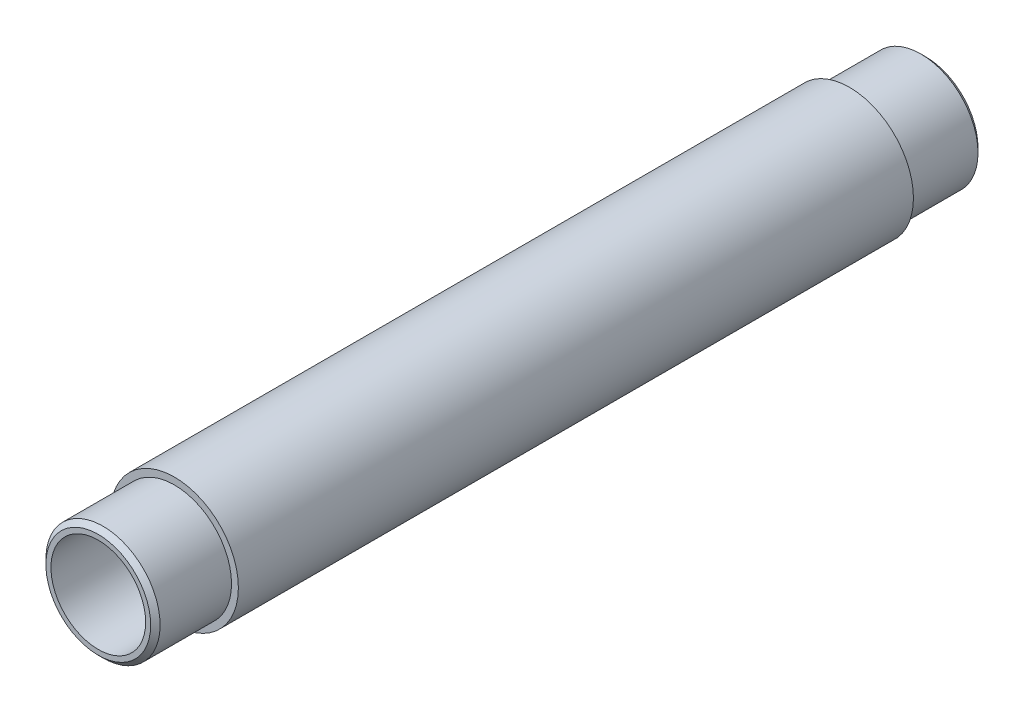
ISO-10303-21;
HEADER;
FILE_DESCRIPTION(('STEP AP214'),'2;1');
FILE_NAME('part.step','',(''),(''),'','','');
FILE_SCHEMA(('AUTOMOTIVE_DESIGN { 1 0 10303 214 1 1 1 1 }'));
ENDSEC;
DATA;
#1=APPLICATION_CONTEXT('core data for automotive mechanical design processes');
#2=APPLICATION_PROTOCOL_DEFINITION('international standard','automotive_design',2000,#1);
#3=PRODUCT_CONTEXT('',#1,'mechanical');
#4=PRODUCT('Part','Part','',(#3));
#5=PRODUCT_RELATED_PRODUCT_CATEGORY('part','',(#4));
#6=PRODUCT_DEFINITION_FORMATION('','',#4);
#7=PRODUCT_DEFINITION_CONTEXT('part definition',#1,'design');
#8=PRODUCT_DEFINITION('design','',#6,#7);
#9=PRODUCT_DEFINITION_SHAPE('','',#8);
#10=(LENGTH_UNIT() NAMED_UNIT(*) SI_UNIT(.MILLI.,.METRE.));
#11=(NAMED_UNIT(*) PLANE_ANGLE_UNIT() SI_UNIT($,.RADIAN.));
#12=(NAMED_UNIT(*) SI_UNIT($,.STERADIAN.) SOLID_ANGLE_UNIT());
#13=UNCERTAINTY_MEASURE_WITH_UNIT(LENGTH_MEASURE(1.E-05),#10,'distance_accuracy_value','');
#14=(GEOMETRIC_REPRESENTATION_CONTEXT(3) GLOBAL_UNCERTAINTY_ASSIGNED_CONTEXT((#13)) GLOBAL_UNIT_ASSIGNED_CONTEXT((#10,
#11,#12)) REPRESENTATION_CONTEXT('',''));
#15=CARTESIAN_POINT('',(0.,0.,0.));
#16=DIRECTION('',(0.,0.,1.));
#17=DIRECTION('',(1.,0.,0.));
#18=AXIS2_PLACEMENT_3D('',#15,#16,#17);
#19=CARTESIAN_POINT('',(0.,0.,-69.));
#20=DIRECTION('',(0.,0.,1.));
#21=DIRECTION('',(1.,0.,0.));
#22=AXIS2_PLACEMENT_3D('',#19,#20,#21);
#23=CYLINDRICAL_SURFACE('',#22,10.668);
#24=CARTESIAN_POINT('',(0.,0.,56.3));
#25=DIRECTION('',(0.,0.,1.));
#26=DIRECTION('',(1.,0.,0.));
#27=AXIS2_PLACEMENT_3D('',#24,#25,#26);
#28=CIRCLE('',#27,10.668);
#29=CARTESIAN_POINT('',(10.668,0.,56.3));
#30=VERTEX_POINT('',#29);
#31=EDGE_CURVE('E58',#30,#30,#28,.F.);
#32=ORIENTED_EDGE('',*,*,#31,.T.);
#33=EDGE_LOOP('',(#32));
#34=FACE_BOUND('',#33,.T.);
#35=CARTESIAN_POINT('',(0.,0.,-56.3));
#36=DIRECTION('',(0.,0.,-1.));
#37=DIRECTION('',(-1.,0.,0.));
#38=AXIS2_PLACEMENT_3D('',#35,#36,#37);
#39=CIRCLE('',#38,10.668);
#40=CARTESIAN_POINT('',(-10.668,0.,-56.3));
#41=VERTEX_POINT('',#40);
#42=EDGE_CURVE('E53',#41,#41,#39,.F.);
#43=ORIENTED_EDGE('',*,*,#42,.T.);
#44=EDGE_LOOP('',(#43));
#45=FACE_BOUND('',#44,.T.);
#46=ADVANCED_FACE('F32',(#34,#45),#23,.T.);
#47=CARTESIAN_POINT('',(0.,0.,-69.));
#48=DIRECTION('',(0.,0.,1.));
#49=DIRECTION('',(1.,0.,0.));
#50=AXIS2_PLACEMENT_3D('',#47,#48,#49);
#51=PLANE('',#50);
#52=CARTESIAN_POINT('',(0.,0.,-69.));
#53=DIRECTION('',(0.,0.,1.));
#54=DIRECTION('',(1.,0.,0.));
#55=AXIS2_PLACEMENT_3D('',#52,#53,#54);
#56=CIRCLE('',#55,8.73760000000003);
#57=CARTESIAN_POINT('',(8.73760000000003,0.,-69.));
#58=VERTEX_POINT('',#57);
#59=EDGE_CURVE('E47',#58,#58,#56,.F.);
#60=ORIENTED_EDGE('',*,*,#59,.T.);
#61=EDGE_LOOP('',(#60));
#62=FACE_BOUND('',#61,.T.);
#63=CARTESIAN_POINT('',(0.,0.,-69.));
#64=DIRECTION('',(0.,0.,1.));
#65=DIRECTION('',(1.,0.,0.));
#66=AXIS2_PLACEMENT_3D('',#63,#64,#65);
#67=CIRCLE('',#66,7.8994);
#68=CARTESIAN_POINT('',(7.8994,0.,-69.));
#69=VERTEX_POINT('',#68);
#70=EDGE_CURVE('E52',#69,#69,#67,.T.);
#71=ORIENTED_EDGE('',*,*,#70,.T.);
#72=EDGE_LOOP('',(#71));
#73=FACE_BOUND('',#72,.T.);
#74=ADVANCED_FACE('F89',(#62,#73),#51,.F.);
#75=CARTESIAN_POINT('',(0.,0.,69.));
#76=DIRECTION('',(0.,0.,1.));
#77=DIRECTION('',(1.,0.,0.));
#78=AXIS2_PLACEMENT_3D('',#75,#76,#77);
#79=PLANE('',#78);
#80=CARTESIAN_POINT('',(0.,0.,69.));
#81=DIRECTION('',(0.,0.,1.));
#82=DIRECTION('',(1.,0.,0.));
#83=AXIS2_PLACEMENT_3D('',#80,#81,#82);
#84=CIRCLE('',#83,8.73760000000003);
#85=CARTESIAN_POINT('',(8.73760000000003,0.,69.));
#86=VERTEX_POINT('',#85);
#87=EDGE_CURVE('E39',#86,#86,#84,.T.);
#88=ORIENTED_EDGE('',*,*,#87,.T.);
#89=EDGE_LOOP('',(#88));
#90=FACE_BOUND('',#89,.T.);
#91=CARTESIAN_POINT('',(0.,0.,69.));
#92=DIRECTION('',(0.,0.,1.));
#93=DIRECTION('',(1.,0.,0.));
#94=AXIS2_PLACEMENT_3D('',#91,#92,#93);
#95=CIRCLE('',#94,7.8994);
#96=CARTESIAN_POINT('',(7.8994,0.,69.));
#97=VERTEX_POINT('',#96);
#98=EDGE_CURVE('E61',#97,#97,#95,.T.);
#99=ORIENTED_EDGE('',*,*,#98,.F.);
#100=EDGE_LOOP('',(#99));
#101=FACE_BOUND('',#100,.T.);
#102=ADVANCED_FACE('F95',(#90,#101),#79,.T.);
#103=CARTESIAN_POINT('',(0.,0.,-69.));
#104=DIRECTION('',(0.,0.,1.));
#105=DIRECTION('',(1.,0.,0.));
#106=AXIS2_PLACEMENT_3D('',#103,#104,#105);
#107=CYLINDRICAL_SURFACE('',#106,7.8994);
#108=ORIENTED_EDGE('',*,*,#70,.F.);
#109=EDGE_LOOP('',(#108));
#110=FACE_BOUND('',#109,.T.);
#111=ORIENTED_EDGE('',*,*,#98,.T.);
#112=EDGE_LOOP('',(#111));
#113=FACE_BOUND('',#112,.T.);
#114=ADVANCED_FACE('F112',(#110,#113),#107,.F.);
#115=CARTESIAN_POINT('',(0.,0.,56.3));
#116=DIRECTION('',(0.,0.,1.));
#117=DIRECTION('',(1.,0.,0.));
#118=AXIS2_PLACEMENT_3D('',#115,#116,#117);
#119=PLANE('',#118);
#120=ORIENTED_EDGE('',*,*,#31,.F.);
#121=EDGE_LOOP('',(#120));
#122=FACE_BOUND('',#121,.T.);
#123=CARTESIAN_POINT('',(0.,0.,56.3));
#124=DIRECTION('',(0.,0.,1.));
#125=DIRECTION('',(1.,0.,0.));
#126=AXIS2_PLACEMENT_3D('',#123,#124,#125);
#127=CIRCLE('',#126,9.525);
#128=CARTESIAN_POINT('',(9.525,0.,56.3));
#129=VERTEX_POINT('',#128);
#130=EDGE_CURVE('E56',#129,#129,#127,.T.);
#131=ORIENTED_EDGE('',*,*,#130,.F.);
#132=EDGE_LOOP('',(#131));
#133=FACE_BOUND('',#132,.T.);
#134=ADVANCED_FACE('F85',(#122,#133),#119,.T.);
#135=CARTESIAN_POINT('',(0.,0.,56.3));
#136=DIRECTION('',(0.,0.,1.));
#137=DIRECTION('',(1.,0.,0.));
#138=AXIS2_PLACEMENT_3D('',#135,#136,#137);
#139=CYLINDRICAL_SURFACE('',#138,9.525);
#140=CARTESIAN_POINT('',(0.,0.,68.2126));
#141=DIRECTION('',(0.,0.,1.));
#142=DIRECTION('',(1.,0.,0.));
#143=AXIS2_PLACEMENT_3D('',#140,#141,#142);
#144=CIRCLE('',#143,9.525);
#145=CARTESIAN_POINT('',(9.525,0.,68.2126));
#146=VERTEX_POINT('',#145);
#147=EDGE_CURVE('E10',#146,#146,#144,.F.);
#148=ORIENTED_EDGE('',*,*,#147,.T.);
#149=EDGE_LOOP('',(#148));
#150=FACE_BOUND('',#149,.T.);
#151=ORIENTED_EDGE('',*,*,#130,.T.);
#152=EDGE_LOOP('',(#151));
#153=FACE_BOUND('',#152,.T.);
#154=ADVANCED_FACE('F75',(#150,#153),#139,.T.);
#155=CARTESIAN_POINT('',(0.,0.,-56.3));
#156=DIRECTION('',(0.,0.,-1.));
#157=DIRECTION('',(-1.,0.,0.));
#158=AXIS2_PLACEMENT_3D('',#155,#156,#157);
#159=PLANE('',#158);
#160=ORIENTED_EDGE('',*,*,#42,.F.);
#161=EDGE_LOOP('',(#160));
#162=FACE_BOUND('',#161,.T.);
#163=CARTESIAN_POINT('',(0.,0.,-56.3));
#164=DIRECTION('',(0.,0.,-1.));
#165=DIRECTION('',(-1.,0.,0.));
#166=AXIS2_PLACEMENT_3D('',#163,#164,#165);
#167=CIRCLE('',#166,9.525);
#168=CARTESIAN_POINT('',(-9.525,0.,-56.3));
#169=VERTEX_POINT('',#168);
#170=EDGE_CURVE('E57',#169,#169,#167,.T.);
#171=ORIENTED_EDGE('',*,*,#170,.F.);
#172=EDGE_LOOP('',(#171));
#173=FACE_BOUND('',#172,.T.);
#174=ADVANCED_FACE('F73',(#162,#173),#159,.T.);
#175=CARTESIAN_POINT('',(0.,0.,-56.3));
#176=DIRECTION('',(0.,0.,-1.));
#177=DIRECTION('',(-1.,0.,0.));
#178=AXIS2_PLACEMENT_3D('',#175,#176,#177);
#179=CYLINDRICAL_SURFACE('',#178,9.525);
#180=CARTESIAN_POINT('',(0.,0.,-68.2126));
#181=DIRECTION('',(0.,0.,1.));
#182=DIRECTION('',(1.,0.,0.));
#183=AXIS2_PLACEMENT_3D('',#180,#181,#182);
#184=CIRCLE('',#183,9.525);
#185=CARTESIAN_POINT('',(9.525,0.,-68.2126));
#186=VERTEX_POINT('',#185);
#187=EDGE_CURVE('E43',#186,#186,#184,.T.);
#188=ORIENTED_EDGE('',*,*,#187,.T.);
#189=EDGE_LOOP('',(#188));
#190=FACE_BOUND('',#189,.T.);
#191=ORIENTED_EDGE('',*,*,#170,.T.);
#192=EDGE_LOOP('',(#191));
#193=FACE_BOUND('',#192,.T.);
#194=ADVANCED_FACE('F71',(#190,#193),#179,.T.);
#195=CARTESIAN_POINT('',(0.,0.,-69.));
#196=DIRECTION('',(0.,0.,1.));
#197=DIRECTION('',(1.,0.,0.));
#198=AXIS2_PLACEMENT_3D('',#195,#196,#197);
#199=CONICAL_SURFACE('',#198,8.73760000000003,0.785398163397445);
#200=ORIENTED_EDGE('',*,*,#187,.F.);
#201=EDGE_LOOP('',(#200));
#202=FACE_BOUND('',#201,.T.);
#203=ORIENTED_EDGE('',*,*,#59,.F.);
#204=EDGE_LOOP('',(#203));
#205=FACE_BOUND('',#204,.T.);
#206=ADVANCED_FACE('F82',(#202,#205),#199,.T.);
#207=CARTESIAN_POINT('',(0.,0.,69.));
#208=DIRECTION('',(0.,0.,-1.));
#209=DIRECTION('',(-1.,0.,0.));
#210=AXIS2_PLACEMENT_3D('',#207,#208,#209);
#211=CONICAL_SURFACE('',#210,8.73760000000003,0.785398163397445);
#212=ORIENTED_EDGE('',*,*,#147,.F.);
#213=EDGE_LOOP('',(#212));
#214=FACE_BOUND('',#213,.T.);
#215=ORIENTED_EDGE('',*,*,#87,.F.);
#216=EDGE_LOOP('',(#215));
#217=FACE_BOUND('',#216,.T.);
#218=ADVANCED_FACE('F34',(#214,#217),#211,.T.);
#219=CLOSED_SHELL('',(#46,#74,#102,#114,#134,#154,#174,#194,#206,#218));
#220=MANIFOLD_SOLID_BREP('B2',#219);
#221=ADVANCED_BREP_SHAPE_REPRESENTATION('',(#18,#220),#14);
#222=SHAPE_DEFINITION_REPRESENTATION(#9,#221);
ENDSEC;
END-ISO-10303-21;
